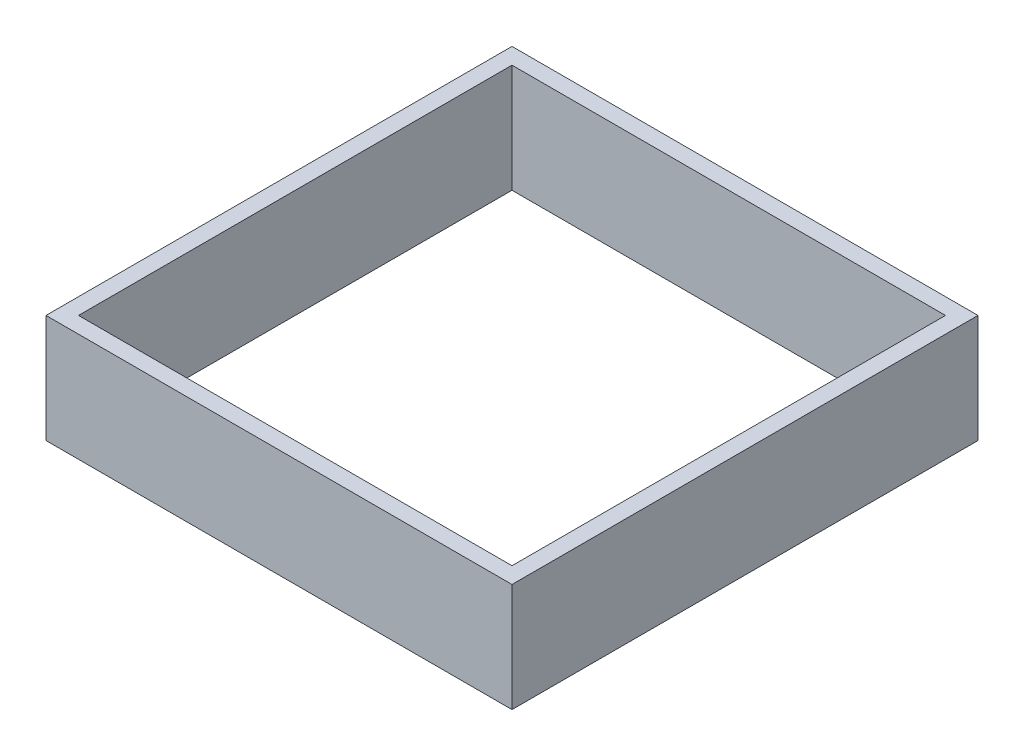
ISO-10303-21;
HEADER;
FILE_DESCRIPTION(('STEP AP214'),'2;1');
FILE_NAME('part.step','',(''),(''),'','','');
FILE_SCHEMA(('AUTOMOTIVE_DESIGN { 1 0 10303 214 1 1 1 1 }'));
ENDSEC;
DATA;
#1=APPLICATION_CONTEXT('core data for automotive mechanical design processes');
#2=APPLICATION_PROTOCOL_DEFINITION('international standard','automotive_design',2000,#1);
#3=PRODUCT_CONTEXT('',#1,'mechanical');
#4=PRODUCT('Part','Part','',(#3));
#5=PRODUCT_RELATED_PRODUCT_CATEGORY('part','',(#4));
#6=PRODUCT_DEFINITION_FORMATION('','',#4);
#7=PRODUCT_DEFINITION_CONTEXT('part definition',#1,'design');
#8=PRODUCT_DEFINITION('design','',#6,#7);
#9=PRODUCT_DEFINITION_SHAPE('','',#8);
#10=(LENGTH_UNIT() NAMED_UNIT(*) SI_UNIT(.MILLI.,.METRE.));
#11=(NAMED_UNIT(*) PLANE_ANGLE_UNIT() SI_UNIT($,.RADIAN.));
#12=(NAMED_UNIT(*) SI_UNIT($,.STERADIAN.) SOLID_ANGLE_UNIT());
#13=UNCERTAINTY_MEASURE_WITH_UNIT(LENGTH_MEASURE(1.E-05),#10,'distance_accuracy_value','');
#14=(GEOMETRIC_REPRESENTATION_CONTEXT(3) GLOBAL_UNCERTAINTY_ASSIGNED_CONTEXT((#13)) GLOBAL_UNIT_ASSIGNED_CONTEXT((#10,
#11,#12)) REPRESENTATION_CONTEXT('',''));
#15=CARTESIAN_POINT('',(0.,0.,0.));
#16=DIRECTION('',(0.,0.,1.));
#17=DIRECTION('',(1.,0.,0.));
#18=AXIS2_PLACEMENT_3D('',#15,#16,#17);
#19=CARTESIAN_POINT('',(0.,10.,0.));
#20=DIRECTION('',(0.,1.,0.));
#21=DIRECTION('',(0.,0.,1.));
#22=AXIS2_PLACEMENT_3D('',#19,#20,#21);
#23=PLANE('',#22);
#24=DIRECTION('',(0.,0.,-1.));
#25=VECTOR('',#24,1.);
#26=CARTESIAN_POINT('',(21.5,10.,21.5));
#27=LINE('',#26,#25);
#28=CARTESIAN_POINT('',(21.5,10.,21.5));
#29=VERTEX_POINT('',#28);
#30=CARTESIAN_POINT('',(21.5,10.,-21.5));
#31=VERTEX_POINT('',#30);
#32=EDGE_CURVE('E134',#29,#31,#27,.T.);
#33=ORIENTED_EDGE('',*,*,#32,.T.);
#34=DIRECTION('',(-1.,0.,0.));
#35=VECTOR('',#34,1.);
#36=CARTESIAN_POINT('',(21.5,10.,-21.5));
#37=LINE('',#36,#35);
#38=CARTESIAN_POINT('',(-21.5,10.,-21.5));
#39=VERTEX_POINT('',#38);
#40=EDGE_CURVE('E137',#31,#39,#37,.T.);
#41=ORIENTED_EDGE('',*,*,#40,.T.);
#42=DIRECTION('',(0.,0.,1.));
#43=VECTOR('',#42,1.);
#44=CARTESIAN_POINT('',(-21.5,10.,21.5));
#45=LINE('',#44,#43);
#46=CARTESIAN_POINT('',(-21.5,10.,21.5));
#47=VERTEX_POINT('',#46);
#48=EDGE_CURVE('E140',#39,#47,#45,.T.);
#49=ORIENTED_EDGE('',*,*,#48,.T.);
#50=DIRECTION('',(1.,0.,0.));
#51=VECTOR('',#50,1.);
#52=CARTESIAN_POINT('',(21.5,10.,21.5));
#53=LINE('',#52,#51);
#54=EDGE_CURVE('E142',#47,#29,#53,.T.);
#55=ORIENTED_EDGE('',*,*,#54,.T.);
#56=EDGE_LOOP('',(#33,#41,#49,#55));
#57=FACE_BOUND('',#56,.T.);
#58=DIRECTION('',(1.,0.,0.));
#59=VECTOR('',#58,1.);
#60=CARTESIAN_POINT('',(20.,10.,20.));
#61=LINE('',#60,#59);
#62=CARTESIAN_POINT('',(-20.,10.,20.));
#63=VERTEX_POINT('',#62);
#64=CARTESIAN_POINT('',(20.,10.,20.));
#65=VERTEX_POINT('',#64);
#66=EDGE_CURVE('E106',#63,#65,#61,.T.);
#67=ORIENTED_EDGE('',*,*,#66,.F.);
#68=DIRECTION('',(0.,0.,1.));
#69=VECTOR('',#68,1.);
#70=CARTESIAN_POINT('',(-20.,10.,20.));
#71=LINE('',#70,#69);
#72=CARTESIAN_POINT('',(-20.,10.,-20.));
#73=VERTEX_POINT('',#72);
#74=EDGE_CURVE('E98',#73,#63,#71,.T.);
#75=ORIENTED_EDGE('',*,*,#74,.F.);
#76=DIRECTION('',(-1.,0.,0.));
#77=VECTOR('',#76,1.);
#78=CARTESIAN_POINT('',(20.,10.,-20.));
#79=LINE('',#78,#77);
#80=CARTESIAN_POINT('',(20.,10.,-20.));
#81=VERTEX_POINT('',#80);
#82=EDGE_CURVE('E120',#81,#73,#79,.T.);
#83=ORIENTED_EDGE('',*,*,#82,.F.);
#84=DIRECTION('',(0.,0.,-1.));
#85=VECTOR('',#84,1.);
#86=CARTESIAN_POINT('',(20.,10.,20.));
#87=LINE('',#86,#85);
#88=EDGE_CURVE('E118',#65,#81,#87,.T.);
#89=ORIENTED_EDGE('',*,*,#88,.F.);
#90=EDGE_LOOP('',(#67,#75,#83,#89));
#91=FACE_BOUND('',#90,.T.);
#92=ADVANCED_FACE('F33',(#57,#91),#23,.T.);
#93=CARTESIAN_POINT('',(0.,0.,0.));
#94=DIRECTION('',(0.,1.,0.));
#95=DIRECTION('',(0.,0.,1.));
#96=AXIS2_PLACEMENT_3D('',#93,#94,#95);
#97=PLANE('',#96);
#98=DIRECTION('',(0.,0.,-1.));
#99=VECTOR('',#98,1.);
#100=CARTESIAN_POINT('',(21.5,0.,21.5));
#101=LINE('',#100,#99);
#102=CARTESIAN_POINT('',(21.5,0.,21.5));
#103=VERTEX_POINT('',#102);
#104=CARTESIAN_POINT('',(21.5,0.,-21.5));
#105=VERTEX_POINT('',#104);
#106=EDGE_CURVE('E114',#103,#105,#101,.T.);
#107=ORIENTED_EDGE('',*,*,#106,.F.);
#108=DIRECTION('',(1.,0.,0.));
#109=VECTOR('',#108,1.);
#110=CARTESIAN_POINT('',(21.5,0.,21.5));
#111=LINE('',#110,#109);
#112=CARTESIAN_POINT('',(-21.5,0.,21.5));
#113=VERTEX_POINT('',#112);
#114=EDGE_CURVE('E138',#113,#103,#111,.T.);
#115=ORIENTED_EDGE('',*,*,#114,.F.);
#116=DIRECTION('',(0.,0.,1.));
#117=VECTOR('',#116,1.);
#118=CARTESIAN_POINT('',(-21.5,0.,21.5));
#119=LINE('',#118,#117);
#120=CARTESIAN_POINT('',(-21.5,0.,-21.5));
#121=VERTEX_POINT('',#120);
#122=EDGE_CURVE('E149',#121,#113,#119,.T.);
#123=ORIENTED_EDGE('',*,*,#122,.F.);
#124=DIRECTION('',(-1.,0.,0.));
#125=VECTOR('',#124,1.);
#126=CARTESIAN_POINT('',(21.5,0.,-21.5));
#127=LINE('',#126,#125);
#128=EDGE_CURVE('E147',#105,#121,#127,.T.);
#129=ORIENTED_EDGE('',*,*,#128,.F.);
#130=EDGE_LOOP('',(#107,#115,#123,#129));
#131=FACE_BOUND('',#130,.T.);
#132=DIRECTION('',(0.,0.,1.));
#133=VECTOR('',#132,1.);
#134=CARTESIAN_POINT('',(-20.,0.,20.));
#135=LINE('',#134,#133);
#136=CARTESIAN_POINT('',(-20.,0.,-20.));
#137=VERTEX_POINT('',#136);
#138=CARTESIAN_POINT('',(-20.,0.,20.));
#139=VERTEX_POINT('',#138);
#140=EDGE_CURVE('E56',#137,#139,#135,.T.);
#141=ORIENTED_EDGE('',*,*,#140,.T.);
#142=DIRECTION('',(1.,0.,0.));
#143=VECTOR('',#142,1.);
#144=CARTESIAN_POINT('',(20.,0.,20.));
#145=LINE('',#144,#143);
#146=CARTESIAN_POINT('',(20.,0.,20.));
#147=VERTEX_POINT('',#146);
#148=EDGE_CURVE('E113',#139,#147,#145,.T.);
#149=ORIENTED_EDGE('',*,*,#148,.T.);
#150=DIRECTION('',(0.,0.,-1.));
#151=VECTOR('',#150,1.);
#152=CARTESIAN_POINT('',(20.,0.,20.));
#153=LINE('',#152,#151);
#154=CARTESIAN_POINT('',(20.,0.,-20.));
#155=VERTEX_POINT('',#154);
#156=EDGE_CURVE('E126',#147,#155,#153,.T.);
#157=ORIENTED_EDGE('',*,*,#156,.T.);
#158=DIRECTION('',(-1.,0.,0.));
#159=VECTOR('',#158,1.);
#160=CARTESIAN_POINT('',(20.,0.,-20.));
#161=LINE('',#160,#159);
#162=EDGE_CURVE('E107',#155,#137,#161,.T.);
#163=ORIENTED_EDGE('',*,*,#162,.T.);
#164=EDGE_LOOP('',(#141,#149,#157,#163));
#165=FACE_BOUND('',#164,.T.);
#166=ADVANCED_FACE('F167',(#131,#165),#97,.F.);
#167=CARTESIAN_POINT('',(21.5,10.,21.5));
#168=DIRECTION('',(-1.,0.,0.));
#169=DIRECTION('',(0.,0.,1.));
#170=AXIS2_PLACEMENT_3D('',#167,#168,#169);
#171=PLANE('',#170);
#172=ORIENTED_EDGE('',*,*,#106,.T.);
#173=DIRECTION('',(0.,-1.,0.));
#174=VECTOR('',#173,1.);
#175=CARTESIAN_POINT('',(21.5,10.,-21.5));
#176=LINE('',#175,#174);
#177=EDGE_CURVE('E11',#31,#105,#176,.T.);
#178=ORIENTED_EDGE('',*,*,#177,.F.);
#179=ORIENTED_EDGE('',*,*,#32,.F.);
#180=DIRECTION('',(0.,-1.,0.));
#181=VECTOR('',#180,1.);
#182=CARTESIAN_POINT('',(21.5,10.,21.5));
#183=LINE('',#182,#181);
#184=EDGE_CURVE('E144',#29,#103,#183,.T.);
#185=ORIENTED_EDGE('',*,*,#184,.T.);
#186=EDGE_LOOP('',(#172,#178,#179,#185));
#187=FACE_BOUND('',#186,.T.);
#188=ADVANCED_FACE('F35',(#187),#171,.F.);
#189=CARTESIAN_POINT('',(21.5,10.,-21.5));
#190=DIRECTION('',(0.,0.,1.));
#191=DIRECTION('',(1.,0.,0.));
#192=AXIS2_PLACEMENT_3D('',#189,#190,#191);
#193=PLANE('',#192);
#194=ORIENTED_EDGE('',*,*,#128,.T.);
#195=DIRECTION('',(0.,-1.,0.));
#196=VECTOR('',#195,1.);
#197=CARTESIAN_POINT('',(-21.5,10.,-21.5));
#198=LINE('',#197,#196);
#199=EDGE_CURVE('E41',#39,#121,#198,.T.);
#200=ORIENTED_EDGE('',*,*,#199,.F.);
#201=ORIENTED_EDGE('',*,*,#40,.F.);
#202=ORIENTED_EDGE('',*,*,#177,.T.);
#203=EDGE_LOOP('',(#194,#200,#201,#202));
#204=FACE_BOUND('',#203,.T.);
#205=ADVANCED_FACE('F177',(#204),#193,.F.);
#206=CARTESIAN_POINT('',(-21.5,10.,21.5));
#207=DIRECTION('',(1.,0.,0.));
#208=DIRECTION('',(0.,0.,-1.));
#209=AXIS2_PLACEMENT_3D('',#206,#207,#208);
#210=PLANE('',#209);
#211=ORIENTED_EDGE('',*,*,#122,.T.);
#212=DIRECTION('',(0.,-1.,0.));
#213=VECTOR('',#212,1.);
#214=CARTESIAN_POINT('',(-21.5,10.,21.5));
#215=LINE('',#214,#213);
#216=EDGE_CURVE('E154',#47,#113,#215,.T.);
#217=ORIENTED_EDGE('',*,*,#216,.F.);
#218=ORIENTED_EDGE('',*,*,#48,.F.);
#219=ORIENTED_EDGE('',*,*,#199,.T.);
#220=EDGE_LOOP('',(#211,#217,#218,#219));
#221=FACE_BOUND('',#220,.T.);
#222=ADVANCED_FACE('F161',(#221),#210,.F.);
#223=CARTESIAN_POINT('',(21.5,10.,21.5));
#224=DIRECTION('',(0.,0.,-1.));
#225=DIRECTION('',(-1.,0.,0.));
#226=AXIS2_PLACEMENT_3D('',#223,#224,#225);
#227=PLANE('',#226);
#228=ORIENTED_EDGE('',*,*,#114,.T.);
#229=ORIENTED_EDGE('',*,*,#184,.F.);
#230=ORIENTED_EDGE('',*,*,#54,.F.);
#231=ORIENTED_EDGE('',*,*,#216,.T.);
#232=EDGE_LOOP('',(#228,#229,#230,#231));
#233=FACE_BOUND('',#232,.T.);
#234=ADVANCED_FACE('F171',(#233),#227,.F.);
#235=CARTESIAN_POINT('',(-20.,10.,20.));
#236=DIRECTION('',(1.,0.,0.));
#237=DIRECTION('',(0.,0.,-1.));
#238=AXIS2_PLACEMENT_3D('',#235,#236,#237);
#239=PLANE('',#238);
#240=ORIENTED_EDGE('',*,*,#140,.F.);
#241=DIRECTION('',(0.,-1.,0.));
#242=VECTOR('',#241,1.);
#243=CARTESIAN_POINT('',(-20.,10.,-20.));
#244=LINE('',#243,#242);
#245=EDGE_CURVE('E102',#73,#137,#244,.T.);
#246=ORIENTED_EDGE('',*,*,#245,.F.);
#247=ORIENTED_EDGE('',*,*,#74,.T.);
#248=DIRECTION('',(0.,-1.,0.));
#249=VECTOR('',#248,1.);
#250=CARTESIAN_POINT('',(-20.,10.,20.));
#251=LINE('',#250,#249);
#252=EDGE_CURVE('E101',#63,#139,#251,.T.);
#253=ORIENTED_EDGE('',*,*,#252,.T.);
#254=EDGE_LOOP('',(#240,#246,#247,#253));
#255=FACE_BOUND('',#254,.T.);
#256=ADVANCED_FACE('F100',(#255),#239,.T.);
#257=CARTESIAN_POINT('',(20.,10.,20.));
#258=DIRECTION('',(0.,0.,-1.));
#259=DIRECTION('',(-1.,0.,0.));
#260=AXIS2_PLACEMENT_3D('',#257,#258,#259);
#261=PLANE('',#260);
#262=ORIENTED_EDGE('',*,*,#148,.F.);
#263=ORIENTED_EDGE('',*,*,#252,.F.);
#264=ORIENTED_EDGE('',*,*,#66,.T.);
#265=DIRECTION('',(0.,-1.,0.));
#266=VECTOR('',#265,1.);
#267=CARTESIAN_POINT('',(20.,10.,20.));
#268=LINE('',#267,#266);
#269=EDGE_CURVE('E115',#65,#147,#268,.T.);
#270=ORIENTED_EDGE('',*,*,#269,.T.);
#271=EDGE_LOOP('',(#262,#263,#264,#270));
#272=FACE_BOUND('',#271,.T.);
#273=ADVANCED_FACE('F110',(#272),#261,.T.);
#274=CARTESIAN_POINT('',(20.,10.,20.));
#275=DIRECTION('',(-1.,0.,0.));
#276=DIRECTION('',(0.,0.,1.));
#277=AXIS2_PLACEMENT_3D('',#274,#275,#276);
#278=PLANE('',#277);
#279=ORIENTED_EDGE('',*,*,#156,.F.);
#280=ORIENTED_EDGE('',*,*,#269,.F.);
#281=ORIENTED_EDGE('',*,*,#88,.T.);
#282=DIRECTION('',(0.,-1.,0.));
#283=VECTOR('',#282,1.);
#284=CARTESIAN_POINT('',(20.,10.,-20.));
#285=LINE('',#284,#283);
#286=EDGE_CURVE('E48',#81,#155,#285,.T.);
#287=ORIENTED_EDGE('',*,*,#286,.T.);
#288=EDGE_LOOP('',(#279,#280,#281,#287));
#289=FACE_BOUND('',#288,.T.);
#290=ADVANCED_FACE('F200',(#289),#278,.T.);
#291=CARTESIAN_POINT('',(20.,10.,-20.));
#292=DIRECTION('',(0.,0.,1.));
#293=DIRECTION('',(1.,0.,0.));
#294=AXIS2_PLACEMENT_3D('',#291,#292,#293);
#295=PLANE('',#294);
#296=ORIENTED_EDGE('',*,*,#162,.F.);
#297=ORIENTED_EDGE('',*,*,#286,.F.);
#298=ORIENTED_EDGE('',*,*,#82,.T.);
#299=ORIENTED_EDGE('',*,*,#245,.T.);
#300=EDGE_LOOP('',(#296,#297,#298,#299));
#301=FACE_BOUND('',#300,.T.);
#302=ADVANCED_FACE('F204',(#301),#295,.T.);
#303=CLOSED_SHELL('',(#92,#166,#188,#205,#222,#234,#256,#273,#290,#302));
#304=MANIFOLD_SOLID_BREP('B2',#303);
#305=ADVANCED_BREP_SHAPE_REPRESENTATION('',(#18,#304),#14);
#306=SHAPE_DEFINITION_REPRESENTATION(#9,#305);
ENDSEC;
END-ISO-10303-21;
